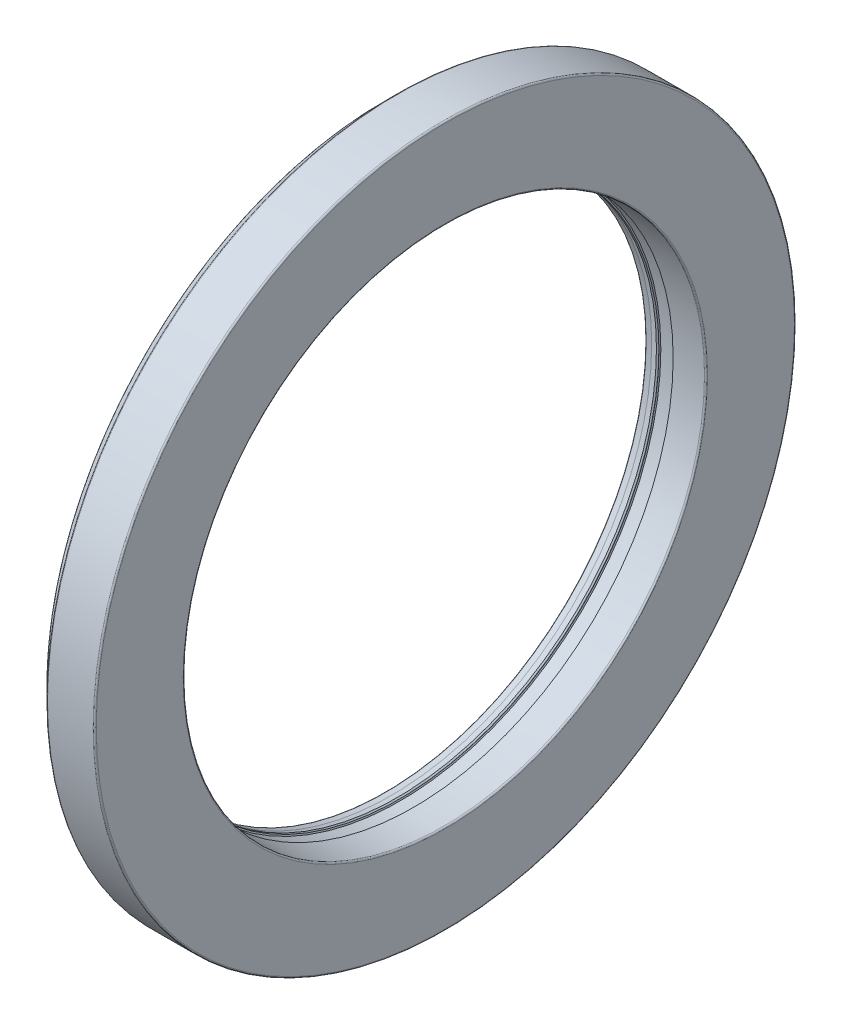
ISO-10303-21;
HEADER;
FILE_DESCRIPTION(('STEP AP214'),'2;1');
FILE_NAME('part.step','',(''),(''),'','','');
FILE_SCHEMA(('AUTOMOTIVE_DESIGN { 1 0 10303 214 1 1 1 1 }'));
ENDSEC;
DATA;
#1=APPLICATION_CONTEXT('core data for automotive mechanical design processes');
#2=APPLICATION_PROTOCOL_DEFINITION('international standard','automotive_design',2000,#1);
#3=PRODUCT_CONTEXT('',#1,'mechanical');
#4=PRODUCT('Part','Part','',(#3));
#5=PRODUCT_RELATED_PRODUCT_CATEGORY('part','',(#4));
#6=PRODUCT_DEFINITION_FORMATION('','',#4);
#7=PRODUCT_DEFINITION_CONTEXT('part definition',#1,'design');
#8=PRODUCT_DEFINITION('design','',#6,#7);
#9=PRODUCT_DEFINITION_SHAPE('','',#8);
#10=(LENGTH_UNIT() NAMED_UNIT(*) SI_UNIT(.MILLI.,.METRE.));
#11=(NAMED_UNIT(*) PLANE_ANGLE_UNIT() SI_UNIT($,.RADIAN.));
#12=(NAMED_UNIT(*) SI_UNIT($,.STERADIAN.) SOLID_ANGLE_UNIT());
#13=UNCERTAINTY_MEASURE_WITH_UNIT(LENGTH_MEASURE(1.E-05),#10,'distance_accuracy_value','');
#14=(GEOMETRIC_REPRESENTATION_CONTEXT(3) GLOBAL_UNCERTAINTY_ASSIGNED_CONTEXT((#13)) GLOBAL_UNIT_ASSIGNED_CONTEXT((#10,
#11,#12)) REPRESENTATION_CONTEXT('',''));
#15=CARTESIAN_POINT('',(0.,0.,0.));
#16=DIRECTION('',(0.,0.,1.));
#17=DIRECTION('',(1.,0.,0.));
#18=AXIS2_PLACEMENT_3D('',#15,#16,#17);
#19=CARTESIAN_POINT('',(-7.79999999999998,0.,0.));
#20=DIRECTION('',(-1.,0.,0.));
#21=DIRECTION('',(0.,0.,1.));
#22=AXIS2_PLACEMENT_3D('',#19,#20,#21);
#23=CONICAL_SURFACE('',#22,8.55,0.201357920790331);
#24=CARTESIAN_POINT('',(-7.60404082057733,0.,0.));
#25=DIRECTION('',(1.,0.,0.));
#26=DIRECTION('',(0.,0.,-1.));
#27=AXIS2_PLACEMENT_3D('',#24,#25,#26);
#28=CIRCLE('',#27,8.51);
#29=CARTESIAN_POINT('',(-7.60404082057733,0.,-8.51));
#30=VERTEX_POINT('',#29);
#31=EDGE_CURVE('E10',#30,#30,#28,.T.);
#32=ORIENTED_EDGE('',*,*,#31,.T.);
#33=EDGE_LOOP('',(#32));
#34=FACE_BOUND('',#33,.T.);
#35=CARTESIAN_POINT('',(-7.79999999999998,0.,0.));
#36=DIRECTION('',(1.,0.,0.));
#37=DIRECTION('',(0.,0.,-1.));
#38=AXIS2_PLACEMENT_3D('',#35,#36,#37);
#39=CIRCLE('',#38,8.55);
#40=CARTESIAN_POINT('',(-7.79999999999998,0.,-8.55));
#41=VERTEX_POINT('',#40);
#42=EDGE_CURVE('E127',#41,#41,#39,.T.);
#43=ORIENTED_EDGE('',*,*,#42,.F.);
#44=EDGE_LOOP('',(#43));
#45=FACE_BOUND('',#44,.T.);
#46=ADVANCED_FACE('F33',(#34,#45),#23,.F.);
#47=CARTESIAN_POINT('',(-7.60404082057733,0.,0.));
#48=DIRECTION('',(1.,0.,0.));
#49=DIRECTION('',(0.,0.,-1.));
#50=AXIS2_PLACEMENT_3D('',#47,#48,#49);
#51=CONICAL_SURFACE('',#50,8.51,0.766086462519649);
#52=CARTESIAN_POINT('',(-7.56246526192086,0.,0.));
#53=DIRECTION('',(1.,0.,0.));
#54=DIRECTION('',(0.,0.,-1.));
#55=AXIS2_PLACEMENT_3D('',#52,#53,#54);
#56=CIRCLE('',#55,8.55);
#57=CARTESIAN_POINT('',(-7.56246526192086,0.,-8.55));
#58=VERTEX_POINT('',#57);
#59=EDGE_CURVE('E39',#58,#58,#56,.T.);
#60=ORIENTED_EDGE('',*,*,#59,.T.);
#61=EDGE_LOOP('',(#60));
#62=FACE_BOUND('',#61,.T.);
#63=ORIENTED_EDGE('',*,*,#31,.F.);
#64=EDGE_LOOP('',(#63));
#65=FACE_BOUND('',#64,.T.);
#66=ADVANCED_FACE('F135',(#62,#65),#51,.F.);
#67=CARTESIAN_POINT('',(0.,0.,0.));
#68=DIRECTION('',(1.,0.,0.));
#69=DIRECTION('',(0.,0.,-1.));
#70=AXIS2_PLACEMENT_3D('',#67,#68,#69);
#71=CYLINDRICAL_SURFACE('',#70,8.55);
#72=CARTESIAN_POINT('',(-7.54202141480087,0.,0.));
#73=DIRECTION('',(1.,0.,0.));
#74=DIRECTION('',(0.,0.,-1.));
#75=AXIS2_PLACEMENT_3D('',#72,#73,#74);
#76=CIRCLE('',#75,8.55);
#77=CARTESIAN_POINT('',(-7.54202141480087,0.,-8.55));
#78=VERTEX_POINT('',#77);
#79=EDGE_CURVE('E43',#78,#78,#76,.T.);
#80=ORIENTED_EDGE('',*,*,#79,.T.);
#81=EDGE_LOOP('',(#80));
#82=FACE_BOUND('',#81,.T.);
#83=ORIENTED_EDGE('',*,*,#59,.F.);
#84=EDGE_LOOP('',(#83));
#85=FACE_BOUND('',#84,.T.);
#86=ADVANCED_FACE('F139',(#82,#85),#71,.F.);
#87=CARTESIAN_POINT('',(-7.54202141480087,0.,0.));
#88=DIRECTION('',(-1.,0.,0.));
#89=DIRECTION('',(0.,0.,1.));
#90=AXIS2_PLACEMENT_3D('',#87,#88,#89);
#91=CONICAL_SURFACE('',#90,8.55,1.10055267079157);
#92=CARTESIAN_POINT('',(-7.52088970326438,0.,0.));
#93=DIRECTION('',(1.,0.,0.));
#94=DIRECTION('',(0.,0.,-1.));
#95=AXIS2_PLACEMENT_3D('',#92,#93,#94);
#96=CIRCLE('',#95,8.50842444134353);
#97=CARTESIAN_POINT('',(-7.52088970326438,0.,-8.50842444134353));
#98=VERTEX_POINT('',#97);
#99=EDGE_CURVE('E47',#98,#98,#96,.T.);
#100=ORIENTED_EDGE('',*,*,#99,.T.);
#101=EDGE_LOOP('',(#100));
#102=FACE_BOUND('',#101,.T.);
#103=ORIENTED_EDGE('',*,*,#79,.F.);
#104=EDGE_LOOP('',(#103));
#105=FACE_BOUND('',#104,.T.);
#106=ADVANCED_FACE('F143',(#102,#105),#91,.F.);
#107=CARTESIAN_POINT('',(-7.52088970326438,0.,0.));
#108=DIRECTION('',(1.,0.,0.));
#109=DIRECTION('',(0.,0.,-1.));
#110=AXIS2_PLACEMENT_3D('',#107,#108,#109);
#111=CONICAL_SURFACE('',#110,8.50842444134353,1.10055267079157);
#112=CARTESIAN_POINT('',(-7.49975799172789,0.,0.));
#113=DIRECTION('',(1.,0.,0.));
#114=DIRECTION('',(0.,0.,-1.));
#115=AXIS2_PLACEMENT_3D('',#112,#113,#114);
#116=CIRCLE('',#115,8.55);
#117=CARTESIAN_POINT('',(-7.49975799172789,0.,-8.55));
#118=VERTEX_POINT('',#117);
#119=EDGE_CURVE('E52',#118,#118,#116,.T.);
#120=ORIENTED_EDGE('',*,*,#119,.T.);
#121=EDGE_LOOP('',(#120));
#122=FACE_BOUND('',#121,.T.);
#123=ORIENTED_EDGE('',*,*,#99,.F.);
#124=EDGE_LOOP('',(#123));
#125=FACE_BOUND('',#124,.T.);
#126=ADVANCED_FACE('F150',(#122,#125),#111,.F.);
#127=CARTESIAN_POINT('',(0.,0.,0.));
#128=DIRECTION('',(1.,0.,0.));
#129=DIRECTION('',(0.,0.,-1.));
#130=AXIS2_PLACEMENT_3D('',#127,#128,#129);
#131=CYLINDRICAL_SURFACE('',#130,8.55);
#132=CARTESIAN_POINT('',(-7.07545991751605,0.,0.));
#133=DIRECTION('',(1.,0.,0.));
#134=DIRECTION('',(0.,0.,-1.));
#135=AXIS2_PLACEMENT_3D('',#132,#133,#134);
#136=CIRCLE('',#135,8.55);
#137=CARTESIAN_POINT('',(-7.07545991751605,0.,-8.55));
#138=VERTEX_POINT('',#137);
#139=EDGE_CURVE('E55',#138,#138,#136,.T.);
#140=ORIENTED_EDGE('',*,*,#139,.T.);
#141=EDGE_LOOP('',(#140));
#142=FACE_BOUND('',#141,.T.);
#143=ORIENTED_EDGE('',*,*,#119,.F.);
#144=EDGE_LOOP('',(#143));
#145=FACE_BOUND('',#144,.T.);
#146=ADVANCED_FACE('F154',(#142,#145),#131,.F.);
#147=CARTESIAN_POINT('',(-7.07545991751605,0.,0.));
#148=DIRECTION('',(-1.,0.,0.));
#149=DIRECTION('',(0.,0.,1.));
#150=AXIS2_PLACEMENT_3D('',#147,#148,#149);
#151=CONICAL_SURFACE('',#150,8.55,1.10055267079157);
#152=CARTESIAN_POINT('',(-7.05432820597956,0.,0.));
#153=DIRECTION('',(1.,0.,0.));
#154=DIRECTION('',(0.,0.,-1.));
#155=AXIS2_PLACEMENT_3D('',#152,#153,#154);
#156=CIRCLE('',#155,8.50842444134353);
#157=CARTESIAN_POINT('',(-7.05432820597956,0.,-8.50842444134353));
#158=VERTEX_POINT('',#157);
#159=EDGE_CURVE('E58',#158,#158,#156,.T.);
#160=ORIENTED_EDGE('',*,*,#159,.T.);
#161=EDGE_LOOP('',(#160));
#162=FACE_BOUND('',#161,.T.);
#163=ORIENTED_EDGE('',*,*,#139,.F.);
#164=EDGE_LOOP('',(#163));
#165=FACE_BOUND('',#164,.T.);
#166=ADVANCED_FACE('F158',(#162,#165),#151,.F.);
#167=CARTESIAN_POINT('',(-7.05432820597956,0.,0.));
#168=DIRECTION('',(1.,0.,0.));
#169=DIRECTION('',(0.,0.,-1.));
#170=AXIS2_PLACEMENT_3D('',#167,#168,#169);
#171=CONICAL_SURFACE('',#170,8.50842444134353,0.0401064707084807);
#172=CARTESIAN_POINT('',(-6.06624959697525,0.,0.));
#173=DIRECTION('',(1.,0.,0.));
#174=DIRECTION('',(0.,0.,-1.));
#175=AXIS2_PLACEMENT_3D('',#172,#173,#174);
#176=CIRCLE('',#175,8.54807404859426);
#177=CARTESIAN_POINT('',(-6.06624959697525,0.,-8.54807404859426));
#178=VERTEX_POINT('',#177);
#179=EDGE_CURVE('E61',#178,#178,#176,.T.);
#180=ORIENTED_EDGE('',*,*,#179,.T.);
#181=EDGE_LOOP('',(#180));
#182=FACE_BOUND('',#181,.T.);
#183=ORIENTED_EDGE('',*,*,#159,.F.);
#184=EDGE_LOOP('',(#183));
#185=FACE_BOUND('',#184,.T.);
#186=ADVANCED_FACE('F162',(#182,#185),#171,.F.);
#187=CARTESIAN_POINT('',(-6.0682543829504,0.,0.));
#188=DIRECTION('',(1.,0.,0.));
#189=DIRECTION('',(0.,0.,-1.));
#190=AXIS2_PLACEMENT_3D('',#187,#188,#189);
#191=TOROIDAL_SURFACE('',#190,8.59803384075949,0.0499999999999997);
#192=CARTESIAN_POINT('',(-6.0182543829504,0.,0.));
#193=DIRECTION('',(1.,0.,0.));
#194=DIRECTION('',(0.,0.,-1.));
#195=AXIS2_PLACEMENT_3D('',#192,#193,#194);
#196=CIRCLE('',#195,8.59803384075949);
#197=CARTESIAN_POINT('',(-6.0182543829504,0.,-8.59803384075949));
#198=VERTEX_POINT('',#197);
#199=EDGE_CURVE('E64',#198,#198,#196,.T.);
#200=ORIENTED_EDGE('',*,*,#199,.T.);
#201=EDGE_LOOP('',(#200));
#202=FACE_BOUND('',#201,.T.);
#203=ORIENTED_EDGE('',*,*,#179,.F.);
#204=EDGE_LOOP('',(#203));
#205=FACE_BOUND('',#204,.T.);
#206=ADVANCED_FACE('F166',(#202,#205),#191,.T.);
#207=CARTESIAN_POINT('',(-6.0182543829504,11.45,0.));
#208=DIRECTION('',(1.,0.,0.));
#209=DIRECTION('',(0.,0.,-1.));
#210=AXIS2_PLACEMENT_3D('',#207,#208,#209);
#211=PLANE('',#210);
#212=CARTESIAN_POINT('',(-6.0182543829504,0.,0.));
#213=DIRECTION('',(1.,0.,0.));
#214=DIRECTION('',(0.,0.,-1.));
#215=AXIS2_PLACEMENT_3D('',#212,#213,#214);
#216=CIRCLE('',#215,11.45);
#217=CARTESIAN_POINT('',(-6.0182543829504,0.,-11.45));
#218=VERTEX_POINT('',#217);
#219=EDGE_CURVE('E67',#218,#218,#216,.T.);
#220=ORIENTED_EDGE('',*,*,#219,.T.);
#221=EDGE_LOOP('',(#220));
#222=FACE_BOUND('',#221,.T.);
#223=ORIENTED_EDGE('',*,*,#199,.F.);
#224=EDGE_LOOP('',(#223));
#225=FACE_BOUND('',#224,.T.);
#226=ADVANCED_FACE('F170',(#222,#225),#211,.T.);
#227=CARTESIAN_POINT('',(-6.0682543829504,0.,0.));
#228=DIRECTION('',(1.,0.,0.));
#229=DIRECTION('',(0.,0.,-1.));
#230=AXIS2_PLACEMENT_3D('',#227,#228,#229);
#231=TOROIDAL_SURFACE('',#230,11.45,0.0499999999999997);
#232=CARTESIAN_POINT('',(-6.0682543829504,0.,0.));
#233=DIRECTION('',(1.,0.,0.));
#234=DIRECTION('',(0.,0.,-1.));
#235=AXIS2_PLACEMENT_3D('',#232,#233,#234);
#236=CIRCLE('',#235,11.5);
#237=CARTESIAN_POINT('',(-6.0682543829504,0.,-11.5));
#238=VERTEX_POINT('',#237);
#239=EDGE_CURVE('E70',#238,#238,#236,.T.);
#240=ORIENTED_EDGE('',*,*,#239,.T.);
#241=EDGE_LOOP('',(#240));
#242=FACE_BOUND('',#241,.T.);
#243=ORIENTED_EDGE('',*,*,#219,.F.);
#244=EDGE_LOOP('',(#243));
#245=FACE_BOUND('',#244,.T.);
#246=ADVANCED_FACE('F174',(#242,#245),#231,.T.);
#247=CARTESIAN_POINT('',(0.,0.,0.));
#248=DIRECTION('',(1.,0.,0.));
#249=DIRECTION('',(0.,0.,-1.));
#250=AXIS2_PLACEMENT_3D('',#247,#248,#249);
#251=CYLINDRICAL_SURFACE('',#250,11.5);
#252=CARTESIAN_POINT('',(-7.56507575950825,0.,0.));
#253=DIRECTION('',(1.,0.,0.));
#254=DIRECTION('',(0.,0.,-1.));
#255=AXIS2_PLACEMENT_3D('',#252,#253,#254);
#256=CIRCLE('',#255,11.5);
#257=CARTESIAN_POINT('',(-7.56507575950825,0.,-11.5));
#258=VERTEX_POINT('',#257);
#259=EDGE_CURVE('E73',#258,#258,#256,.T.);
#260=ORIENTED_EDGE('',*,*,#259,.T.);
#261=EDGE_LOOP('',(#260));
#262=FACE_BOUND('',#261,.T.);
#263=ORIENTED_EDGE('',*,*,#239,.F.);
#264=EDGE_LOOP('',(#263));
#265=FACE_BOUND('',#264,.T.);
#266=ADVANCED_FACE('F178',(#262,#265),#251,.T.);
#267=CARTESIAN_POINT('',(-7.56507575950825,0.,0.));
#268=DIRECTION('',(1.,0.,0.));
#269=DIRECTION('',(0.,0.,-1.));
#270=AXIS2_PLACEMENT_3D('',#267,#268,#269);
#271=TOROIDAL_SURFACE('',#270,11.45,0.0499999999999996);
#272=CARTESIAN_POINT('',(-7.60043109856758,0.,0.));
#273=DIRECTION('',(1.,0.,0.));
#274=DIRECTION('',(0.,0.,-1.));
#275=AXIS2_PLACEMENT_3D('',#272,#273,#274);
#276=CIRCLE('',#275,11.4853553390593);
#277=CARTESIAN_POINT('',(-7.60043109856758,0.,-11.4853553390593));
#278=VERTEX_POINT('',#277);
#279=EDGE_CURVE('E76',#278,#278,#276,.T.);
#280=ORIENTED_EDGE('',*,*,#279,.T.);
#281=EDGE_LOOP('',(#280));
#282=FACE_BOUND('',#281,.T.);
#283=ORIENTED_EDGE('',*,*,#259,.F.);
#284=EDGE_LOOP('',(#283));
#285=FACE_BOUND('',#284,.T.);
#286=ADVANCED_FACE('F182',(#282,#285),#271,.T.);
#287=CARTESIAN_POINT('',(-7.60043109856758,0.,0.));
#288=DIRECTION('',(1.,0.,0.));
#289=DIRECTION('',(0.,0.,-1.));
#290=AXIS2_PLACEMENT_3D('',#287,#288,#289);
#291=CONICAL_SURFACE('',#290,11.4853553390593,0.785398163397448);
#292=CARTESIAN_POINT('',(-7.98535533905932,0.,0.));
#293=DIRECTION('',(1.,0.,0.));
#294=DIRECTION('',(0.,0.,-1.));
#295=AXIS2_PLACEMENT_3D('',#292,#293,#294);
#296=CIRCLE('',#295,11.1004310985676);
#297=CARTESIAN_POINT('',(-7.98535533905932,0.,-11.1004310985676));
#298=VERTEX_POINT('',#297);
#299=EDGE_CURVE('E79',#298,#298,#296,.T.);
#300=ORIENTED_EDGE('',*,*,#299,.T.);
#301=EDGE_LOOP('',(#300));
#302=FACE_BOUND('',#301,.T.);
#303=ORIENTED_EDGE('',*,*,#279,.F.);
#304=EDGE_LOOP('',(#303));
#305=FACE_BOUND('',#304,.T.);
#306=ADVANCED_FACE('F186',(#302,#305),#291,.T.);
#307=CARTESIAN_POINT('',(-7.95,0.,0.));
#308=DIRECTION('',(1.,0.,0.));
#309=DIRECTION('',(0.,0.,-1.));
#310=AXIS2_PLACEMENT_3D('',#307,#308,#309);
#311=TOROIDAL_SURFACE('',#310,11.0650757595083,0.0499999999999999);
#312=CARTESIAN_POINT('',(-8.,0.,0.));
#313=DIRECTION('',(1.,0.,0.));
#314=DIRECTION('',(0.,0.,-1.));
#315=AXIS2_PLACEMENT_3D('',#312,#313,#314);
#316=CIRCLE('',#315,11.0650757595083);
#317=CARTESIAN_POINT('',(-8.,0.,-11.0650757595083));
#318=VERTEX_POINT('',#317);
#319=EDGE_CURVE('E82',#318,#318,#316,.T.);
#320=ORIENTED_EDGE('',*,*,#319,.T.);
#321=EDGE_LOOP('',(#320));
#322=FACE_BOUND('',#321,.T.);
#323=ORIENTED_EDGE('',*,*,#299,.F.);
#324=EDGE_LOOP('',(#323));
#325=FACE_BOUND('',#324,.T.);
#326=ADVANCED_FACE('F190',(#322,#325),#311,.T.);
#327=CARTESIAN_POINT('',(-7.99999999999999,9.32284520082397,0.));
#328=DIRECTION('',(-1.,0.,0.));
#329=DIRECTION('',(0.,0.,1.));
#330=AXIS2_PLACEMENT_3D('',#327,#328,#329);
#331=PLANE('',#330);
#332=CARTESIAN_POINT('',(-7.99999999999999,0.,0.));
#333=DIRECTION('',(1.,0.,0.));
#334=DIRECTION('',(0.,0.,-1.));
#335=AXIS2_PLACEMENT_3D('',#332,#333,#334);
#336=CIRCLE('',#335,9.32284520082397);
#337=CARTESIAN_POINT('',(-7.99999999999999,0.,-9.32284520082397));
#338=VERTEX_POINT('',#337);
#339=EDGE_CURVE('E85',#338,#338,#336,.T.);
#340=ORIENTED_EDGE('',*,*,#339,.T.);
#341=EDGE_LOOP('',(#340));
#342=FACE_BOUND('',#341,.T.);
#343=ORIENTED_EDGE('',*,*,#319,.F.);
#344=EDGE_LOOP('',(#343));
#345=FACE_BOUND('',#344,.T.);
#346=ADVANCED_FACE('F194',(#342,#345),#331,.T.);
#347=CARTESIAN_POINT('',(-7.94999999999999,0.,0.));
#348=DIRECTION('',(1.,0.,0.));
#349=DIRECTION('',(0.,0.,-1.));
#350=AXIS2_PLACEMENT_3D('',#347,#348,#349);
#351=TOROIDAL_SURFACE('',#350,9.32284520082397,0.0499999999999997);
#352=CARTESIAN_POINT('',(-7.94999999999999,0.,0.));
#353=DIRECTION('',(1.,0.,0.));
#354=DIRECTION('',(0.,0.,-1.));
#355=AXIS2_PLACEMENT_3D('',#352,#353,#354);
#356=CIRCLE('',#355,9.27284520082397);
#357=CARTESIAN_POINT('',(-7.94999999999999,0.,-9.27284520082397));
#358=VERTEX_POINT('',#357);
#359=EDGE_CURVE('E88',#358,#358,#356,.T.);
#360=ORIENTED_EDGE('',*,*,#359,.T.);
#361=EDGE_LOOP('',(#360));
#362=FACE_BOUND('',#361,.T.);
#363=ORIENTED_EDGE('',*,*,#339,.F.);
#364=EDGE_LOOP('',(#363));
#365=FACE_BOUND('',#364,.T.);
#366=ADVANCED_FACE('F198',(#362,#365),#351,.T.);
#367=CARTESIAN_POINT('',(0.,0.,0.));
#368=DIRECTION('',(1.,0.,0.));
#369=DIRECTION('',(0.,0.,-1.));
#370=AXIS2_PLACEMENT_3D('',#367,#368,#369);
#371=CYLINDRICAL_SURFACE('',#370,9.27284520082397);
#372=CARTESIAN_POINT('',(-7.15286255019813,0.,0.));
#373=DIRECTION('',(1.,0.,0.));
#374=DIRECTION('',(0.,0.,-1.));
#375=AXIS2_PLACEMENT_3D('',#372,#373,#374);
#376=CIRCLE('',#375,9.27284520082397);
#377=CARTESIAN_POINT('',(-7.15286255019813,0.,-9.27284520082397));
#378=VERTEX_POINT('',#377);
#379=EDGE_CURVE('E91',#378,#378,#376,.T.);
#380=ORIENTED_EDGE('',*,*,#379,.T.);
#381=EDGE_LOOP('',(#380));
#382=FACE_BOUND('',#381,.T.);
#383=ORIENTED_EDGE('',*,*,#359,.F.);
#384=EDGE_LOOP('',(#383));
#385=FACE_BOUND('',#384,.T.);
#386=ADVANCED_FACE('F202',(#382,#385),#371,.F.);
#387=CARTESIAN_POINT('',(-7.15286255019813,0.,0.));
#388=DIRECTION('',(1.,0.,0.));
#389=DIRECTION('',(0.,0.,-1.));
#390=AXIS2_PLACEMENT_3D('',#387,#388,#389);
#391=TOROIDAL_SURFACE('',#390,9.29284520082397,0.0199999999999996);
#392=CARTESIAN_POINT('',(-7.13286255019813,0.,0.));
#393=DIRECTION('',(1.,0.,0.));
#394=DIRECTION('',(0.,0.,-1.));
#395=AXIS2_PLACEMENT_3D('',#392,#393,#394);
#396=CIRCLE('',#395,9.29284520082397);
#397=CARTESIAN_POINT('',(-7.13286255019813,0.,-9.29284520082397));
#398=VERTEX_POINT('',#397);
#399=EDGE_CURVE('E94',#398,#398,#396,.T.);
#400=ORIENTED_EDGE('',*,*,#399,.T.);
#401=EDGE_LOOP('',(#400));
#402=FACE_BOUND('',#401,.T.);
#403=ORIENTED_EDGE('',*,*,#379,.F.);
#404=EDGE_LOOP('',(#403));
#405=FACE_BOUND('',#404,.T.);
#406=ADVANCED_FACE('F206',(#402,#405),#391,.T.);
#407=CARTESIAN_POINT('',(-7.13286255019813,9.31678212511425,0.));
#408=DIRECTION('',(1.,0.,0.));
#409=DIRECTION('',(0.,0.,-1.));
#410=AXIS2_PLACEMENT_3D('',#407,#408,#409);
#411=PLANE('',#410);
#412=CARTESIAN_POINT('',(-7.13286255019813,0.,0.));
#413=DIRECTION('',(1.,0.,0.));
#414=DIRECTION('',(0.,0.,-1.));
#415=AXIS2_PLACEMENT_3D('',#412,#413,#414);
#416=CIRCLE('',#415,9.31678212511425);
#417=CARTESIAN_POINT('',(-7.13286255019813,0.,-9.31678212511425));
#418=VERTEX_POINT('',#417);
#419=EDGE_CURVE('E97',#418,#418,#416,.T.);
#420=ORIENTED_EDGE('',*,*,#419,.T.);
#421=EDGE_LOOP('',(#420));
#422=FACE_BOUND('',#421,.T.);
#423=ORIENTED_EDGE('',*,*,#399,.F.);
#424=EDGE_LOOP('',(#423));
#425=FACE_BOUND('',#424,.T.);
#426=ADVANCED_FACE('F210',(#422,#425),#411,.T.);
#427=CARTESIAN_POINT('',(-7.08286255019813,0.,0.));
#428=DIRECTION('',(1.,0.,0.));
#429=DIRECTION('',(0.,0.,-1.));
#430=AXIS2_PLACEMENT_3D('',#427,#428,#429);
#431=TOROIDAL_SURFACE('',#430,9.31678212511425,0.0499999999999997);
#432=CARTESIAN_POINT('',(-7.08286255019813,0.,0.));
#433=DIRECTION('',(1.,0.,0.));
#434=DIRECTION('',(0.,0.,-1.));
#435=AXIS2_PLACEMENT_3D('',#432,#433,#434);
#436=CIRCLE('',#435,9.36678212511425);
#437=CARTESIAN_POINT('',(-7.08286255019813,0.,-9.36678212511425));
#438=VERTEX_POINT('',#437);
#439=EDGE_CURVE('E100',#438,#438,#436,.T.);
#440=ORIENTED_EDGE('',*,*,#439,.T.);
#441=EDGE_LOOP('',(#440));
#442=FACE_BOUND('',#441,.T.);
#443=ORIENTED_EDGE('',*,*,#419,.F.);
#444=EDGE_LOOP('',(#443));
#445=FACE_BOUND('',#444,.T.);
#446=ADVANCED_FACE('F214',(#442,#445),#431,.F.);
#447=CARTESIAN_POINT('',(0.,0.,0.));
#448=DIRECTION('',(1.,0.,0.));
#449=DIRECTION('',(0.,0.,-1.));
#450=AXIS2_PLACEMENT_3D('',#447,#448,#449);
#451=CYLINDRICAL_SURFACE('',#450,9.36678212511425);
#452=CARTESIAN_POINT('',(-6.79537273750075,0.,0.));
#453=DIRECTION('',(1.,0.,0.));
#454=DIRECTION('',(0.,0.,-1.));
#455=AXIS2_PLACEMENT_3D('',#452,#453,#454);
#456=CIRCLE('',#455,9.36678212511425);
#457=CARTESIAN_POINT('',(-6.79537273750075,0.,-9.36678212511425));
#458=VERTEX_POINT('',#457);
#459=EDGE_CURVE('E103',#458,#458,#456,.T.);
#460=ORIENTED_EDGE('',*,*,#459,.T.);
#461=EDGE_LOOP('',(#460));
#462=FACE_BOUND('',#461,.T.);
#463=ORIENTED_EDGE('',*,*,#439,.F.);
#464=EDGE_LOOP('',(#463));
#465=FACE_BOUND('',#464,.T.);
#466=ADVANCED_FACE('F218',(#462,#465),#451,.F.);
#467=CARTESIAN_POINT('',(-6.79537273750075,0.,0.));
#468=DIRECTION('',(1.,0.,0.));
#469=DIRECTION('',(0.,0.,-1.));
#470=AXIS2_PLACEMENT_3D('',#467,#468,#469);
#471=TOROIDAL_SURFACE('',#470,9.31678212511425,0.0499999999999997);
#472=CARTESIAN_POINT('',(-6.74537273750075,0.,0.));
#473=DIRECTION('',(1.,0.,0.));
#474=DIRECTION('',(0.,0.,-1.));
#475=AXIS2_PLACEMENT_3D('',#472,#473,#474);
#476=CIRCLE('',#475,9.31678212511425);
#477=CARTESIAN_POINT('',(-6.74537273750075,0.,-9.31678212511425));
#478=VERTEX_POINT('',#477);
#479=EDGE_CURVE('E106',#478,#478,#476,.T.);
#480=ORIENTED_EDGE('',*,*,#479,.T.);
#481=EDGE_LOOP('',(#480));
#482=FACE_BOUND('',#481,.T.);
#483=ORIENTED_EDGE('',*,*,#459,.F.);
#484=EDGE_LOOP('',(#483));
#485=FACE_BOUND('',#484,.T.);
#486=ADVANCED_FACE('F222',(#482,#485),#471,.F.);
#487=CARTESIAN_POINT('',(-6.74537273750075,9.09408704887488,0.));
#488=DIRECTION('',(-1.,0.,0.));
#489=DIRECTION('',(0.,0.,1.));
#490=AXIS2_PLACEMENT_3D('',#487,#488,#489);
#491=PLANE('',#490);
#492=CARTESIAN_POINT('',(-6.74537273750075,0.,0.));
#493=DIRECTION('',(1.,0.,0.));
#494=DIRECTION('',(0.,0.,-1.));
#495=AXIS2_PLACEMENT_3D('',#492,#493,#494);
#496=CIRCLE('',#495,9.09408704887488);
#497=CARTESIAN_POINT('',(-6.74537273750075,0.,-9.09408704887488));
#498=VERTEX_POINT('',#497);
#499=EDGE_CURVE('E109',#498,#498,#496,.T.);
#500=ORIENTED_EDGE('',*,*,#499,.T.);
#501=EDGE_LOOP('',(#500));
#502=FACE_BOUND('',#501,.T.);
#503=ORIENTED_EDGE('',*,*,#479,.F.);
#504=EDGE_LOOP('',(#503));
#505=FACE_BOUND('',#504,.T.);
#506=ADVANCED_FACE('F226',(#502,#505),#491,.T.);
#507=CARTESIAN_POINT('',(-6.79537273750075,0.,0.));
#508=DIRECTION('',(1.,0.,0.));
#509=DIRECTION('',(0.,0.,-1.));
#510=AXIS2_PLACEMENT_3D('',#507,#508,#509);
#511=TOROIDAL_SURFACE('',#510,9.09408704887488,0.0500000000000001);
#512=CARTESIAN_POINT('',(-6.78939695055029,0.,0.));
#513=DIRECTION('',(1.,0.,0.));
#514=DIRECTION('',(0.,0.,-1.));
#515=AXIS2_PLACEMENT_3D('',#512,#513,#514);
#516=CIRCLE('',#515,9.04444543356753);
#517=CARTESIAN_POINT('',(-6.78939695055029,0.,-9.04444543356753));
#518=VERTEX_POINT('',#517);
#519=EDGE_CURVE('E112',#518,#518,#516,.T.);
#520=ORIENTED_EDGE('',*,*,#519,.T.);
#521=EDGE_LOOP('',(#520));
#522=FACE_BOUND('',#521,.T.);
#523=ORIENTED_EDGE('',*,*,#499,.F.);
#524=EDGE_LOOP('',(#523));
#525=FACE_BOUND('',#524,.T.);
#526=ADVANCED_FACE('F230',(#522,#525),#511,.F.);
#527=CARTESIAN_POINT('',(-6.78939695055029,0.,0.));
#528=DIRECTION('',(1.,0.,0.));
#529=DIRECTION('',(0.,0.,-1.));
#530=AXIS2_PLACEMENT_3D('',#527,#528,#529);
#531=CONICAL_SURFACE('',#530,9.04444543356753,0.119802110970957);
#532=CARTESIAN_POINT('',(-7.95597578695045,0.,0.));
#533=DIRECTION('',(1.,0.,0.));
#534=DIRECTION('',(0.,0.,-1.));
#535=AXIS2_PLACEMENT_3D('',#532,#533,#534);
#536=CIRCLE('',#535,8.90401433469846);
#537=CARTESIAN_POINT('',(-7.95597578695045,0.,-8.90401433469846));
#538=VERTEX_POINT('',#537);
#539=EDGE_CURVE('E115',#538,#538,#536,.T.);
#540=ORIENTED_EDGE('',*,*,#539,.T.);
#541=EDGE_LOOP('',(#540));
#542=FACE_BOUND('',#541,.T.);
#543=ORIENTED_EDGE('',*,*,#519,.F.);
#544=EDGE_LOOP('',(#543));
#545=FACE_BOUND('',#544,.T.);
#546=ADVANCED_FACE('F234',(#542,#545),#531,.T.);
#547=CARTESIAN_POINT('',(-7.94999999999999,0.,0.));
#548=DIRECTION('',(1.,0.,0.));
#549=DIRECTION('',(0.,0.,-1.));
#550=AXIS2_PLACEMENT_3D('',#547,#548,#549);
#551=TOROIDAL_SURFACE('',#550,8.85437271939112,0.05);
#552=CARTESIAN_POINT('',(-7.99999999999998,0.,0.));
#553=DIRECTION('',(1.,0.,0.));
#554=DIRECTION('',(0.,0.,-1.));
#555=AXIS2_PLACEMENT_3D('',#552,#553,#554);
#556=CIRCLE('',#555,8.85437271939112);
#557=CARTESIAN_POINT('',(-7.99999999999998,0.,-8.85437271939112));
#558=VERTEX_POINT('',#557);
#559=EDGE_CURVE('E118',#558,#558,#556,.T.);
#560=ORIENTED_EDGE('',*,*,#559,.T.);
#561=EDGE_LOOP('',(#560));
#562=FACE_BOUND('',#561,.T.);
#563=ORIENTED_EDGE('',*,*,#539,.F.);
#564=EDGE_LOOP('',(#563));
#565=FACE_BOUND('',#564,.T.);
#566=ADVANCED_FACE('F238',(#562,#565),#551,.T.);
#567=CARTESIAN_POINT('',(-7.99999999999998,8.57,0.));
#568=DIRECTION('',(-1.,0.,0.));
#569=DIRECTION('',(0.,0.,1.));
#570=AXIS2_PLACEMENT_3D('',#567,#568,#569);
#571=PLANE('',#570);
#572=CARTESIAN_POINT('',(-7.99999999999998,0.,0.));
#573=DIRECTION('',(1.,0.,0.));
#574=DIRECTION('',(0.,0.,-1.));
#575=AXIS2_PLACEMENT_3D('',#572,#573,#574);
#576=CIRCLE('',#575,8.57);
#577=CARTESIAN_POINT('',(-7.99999999999998,0.,-8.57));
#578=VERTEX_POINT('',#577);
#579=EDGE_CURVE('E121',#578,#578,#576,.T.);
#580=ORIENTED_EDGE('',*,*,#579,.T.);
#581=EDGE_LOOP('',(#580));
#582=FACE_BOUND('',#581,.T.);
#583=ORIENTED_EDGE('',*,*,#559,.F.);
#584=EDGE_LOOP('',(#583));
#585=FACE_BOUND('',#584,.T.);
#586=ADVANCED_FACE('F242',(#582,#585),#571,.T.);
#587=CARTESIAN_POINT('',(-7.97999999999998,0.,0.));
#588=DIRECTION('',(1.,0.,0.));
#589=DIRECTION('',(0.,0.,-1.));
#590=AXIS2_PLACEMENT_3D('',#587,#588,#589);
#591=TOROIDAL_SURFACE('',#590,8.57,0.0199999999999992);
#592=CARTESIAN_POINT('',(-7.97999999999998,0.,0.));
#593=DIRECTION('',(1.,0.,0.));
#594=DIRECTION('',(0.,0.,-1.));
#595=AXIS2_PLACEMENT_3D('',#592,#593,#594);
#596=CIRCLE('',#595,8.55);
#597=CARTESIAN_POINT('',(-7.97999999999998,0.,-8.55));
#598=VERTEX_POINT('',#597);
#599=EDGE_CURVE('E124',#598,#598,#596,.T.);
#600=ORIENTED_EDGE('',*,*,#599,.T.);
#601=EDGE_LOOP('',(#600));
#602=FACE_BOUND('',#601,.T.);
#603=ORIENTED_EDGE('',*,*,#579,.F.);
#604=EDGE_LOOP('',(#603));
#605=FACE_BOUND('',#604,.T.);
#606=ADVANCED_FACE('F246',(#602,#605),#591,.T.);
#607=CARTESIAN_POINT('',(0.,0.,0.));
#608=DIRECTION('',(1.,0.,0.));
#609=DIRECTION('',(0.,0.,-1.));
#610=AXIS2_PLACEMENT_3D('',#607,#608,#609);
#611=CYLINDRICAL_SURFACE('',#610,8.55);
#612=ORIENTED_EDGE('',*,*,#42,.T.);
#613=EDGE_LOOP('',(#612));
#614=FACE_BOUND('',#613,.T.);
#615=ORIENTED_EDGE('',*,*,#599,.F.);
#616=EDGE_LOOP('',(#615));
#617=FACE_BOUND('',#616,.T.);
#618=ADVANCED_FACE('F131',(#614,#617),#611,.F.);
#619=CLOSED_SHELL('',(#46,#66,#86,#106,#126,#146,#166,#186,#206,#226,#246,#266,#286,#306,#326,
#346,#366,#386,#406,#426,#446,#466,#486,#506,#526,#546,#566,#586,#606,#618));
#620=MANIFOLD_SOLID_BREP('B2',#619);
#621=ADVANCED_BREP_SHAPE_REPRESENTATION('',(#18,#620),#14);
#622=SHAPE_DEFINITION_REPRESENTATION(#9,#621);
ENDSEC;
END-ISO-10303-21;
